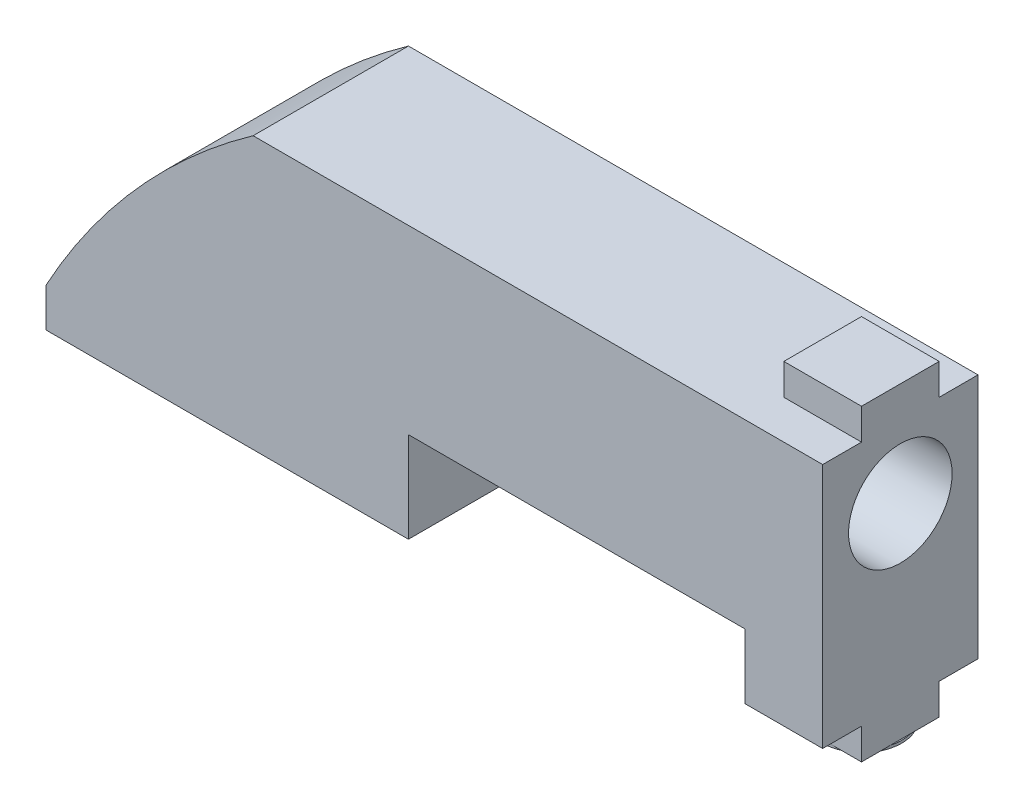
ISO-10303-21;
HEADER;
FILE_DESCRIPTION(('STEP AP214'),'2;1');
FILE_NAME('part.step','',(''),(''),'','','');
FILE_SCHEMA(('AUTOMOTIVE_DESIGN { 1 0 10303 214 1 1 1 1 }'));
ENDSEC;
DATA;
#1=APPLICATION_CONTEXT('core data for automotive mechanical design processes');
#2=APPLICATION_PROTOCOL_DEFINITION('international standard','automotive_design',2000,#1);
#3=PRODUCT_CONTEXT('',#1,'mechanical');
#4=PRODUCT('Part','Part','',(#3));
#5=PRODUCT_RELATED_PRODUCT_CATEGORY('part','',(#4));
#6=PRODUCT_DEFINITION_FORMATION('','',#4);
#7=PRODUCT_DEFINITION_CONTEXT('part definition',#1,'design');
#8=PRODUCT_DEFINITION('design','',#6,#7);
#9=PRODUCT_DEFINITION_SHAPE('','',#8);
#10=(LENGTH_UNIT() NAMED_UNIT(*) SI_UNIT(.MILLI.,.METRE.));
#11=(NAMED_UNIT(*) PLANE_ANGLE_UNIT() SI_UNIT($,.RADIAN.));
#12=(NAMED_UNIT(*) SI_UNIT($,.STERADIAN.) SOLID_ANGLE_UNIT());
#13=UNCERTAINTY_MEASURE_WITH_UNIT(LENGTH_MEASURE(1.E-05),#10,'distance_accuracy_value','');
#14=(GEOMETRIC_REPRESENTATION_CONTEXT(3) GLOBAL_UNCERTAINTY_ASSIGNED_CONTEXT((#13)) GLOBAL_UNIT_ASSIGNED_CONTEXT((#10,
#11,#12)) REPRESENTATION_CONTEXT('',''));
#15=CARTESIAN_POINT('',(0.,0.,0.));
#16=DIRECTION('',(0.,0.,1.));
#17=DIRECTION('',(1.,0.,0.));
#18=AXIS2_PLACEMENT_3D('',#15,#16,#17);
#19=CARTESIAN_POINT('',(30.,-0.199999999999999,-1.5));
#20=DIRECTION('',(0.,-1.,0.));
#21=DIRECTION('',(0.,0.,-1.));
#22=AXIS2_PLACEMENT_3D('',#19,#20,#21);
#23=PLANE('',#22);
#24=CARTESIAN_POINT('',(28.5256154225237,-0.199999999999999,0.));
#25=DIRECTION('',(0.,-1.,0.));
#26=DIRECTION('',(0.,0.,-1.));
#27=AXIS2_PLACEMENT_3D('',#24,#25,#26);
#28=CIRCLE('',#27,1.52561542252374);
#29=CARTESIAN_POINT('',(28.8040079824859,-0.199999999999999,-1.5));
#30=VERTEX_POINT('',#29);
#31=CARTESIAN_POINT('',(30.,-0.199999999999999,-0.392036395175811));
#32=VERTEX_POINT('',#31);
#33=EDGE_CURVE('E57',#30,#32,#28,.T.);
#34=ORIENTED_EDGE('',*,*,#33,.F.);
#35=DIRECTION('',(1.,0.,0.));
#36=VECTOR('',#35,1.);
#37=CARTESIAN_POINT('',(27.,-0.199999999999999,-1.5));
#38=LINE('',#37,#36);
#39=CARTESIAN_POINT('',(30.,-0.199999999999999,-1.5));
#40=VERTEX_POINT('',#39);
#41=EDGE_CURVE('E193',#30,#40,#38,.T.);
#42=ORIENTED_EDGE('',*,*,#41,.T.);
#43=DIRECTION('',(0.,0.,1.));
#44=VECTOR('',#43,1.);
#45=CARTESIAN_POINT('',(30.,-0.199999999999999,1.5));
#46=LINE('',#45,#44);
#47=EDGE_CURVE('E230',#40,#32,#46,.T.);
#48=ORIENTED_EDGE('',*,*,#47,.T.);
#49=EDGE_LOOP('',(#34,#42,#48));
#50=FACE_BOUND('',#49,.T.);
#51=ADVANCED_FACE('F39',(#50),#23,.T.);
#52=CARTESIAN_POINT('',(30.,-0.199999999999999,0.392036395175811));
#53=VERTEX_POINT('',#52);
#54=CARTESIAN_POINT('',(28.8040079824859,-0.199999999999999,1.5));
#55=VERTEX_POINT('',#54);
#56=EDGE_CURVE('E12',#53,#55,#28,.T.);
#57=ORIENTED_EDGE('',*,*,#56,.F.);
#58=CARTESIAN_POINT('',(30.,-0.199999999999999,1.5));
#59=VERTEX_POINT('',#58);
#60=EDGE_CURVE('E242',#53,#59,#46,.T.);
#61=ORIENTED_EDGE('',*,*,#60,.T.);
#62=DIRECTION('',(-1.,0.,0.));
#63=VECTOR('',#62,1.);
#64=CARTESIAN_POINT('',(27.,-0.199999999999999,1.5));
#65=LINE('',#64,#63);
#66=EDGE_CURVE('E227',#59,#55,#65,.T.);
#67=ORIENTED_EDGE('',*,*,#66,.T.);
#68=EDGE_LOOP('',(#57,#61,#67));
#69=FACE_BOUND('',#68,.T.);
#70=ADVANCED_FACE('F419',(#69),#23,.T.);
#71=CARTESIAN_POINT('',(28.2472228625616,-0.199999999999999,1.5));
#72=VERTEX_POINT('',#71);
#73=CARTESIAN_POINT('',(27.,-0.199999999999999,0.));
#74=VERTEX_POINT('',#73);
#75=EDGE_CURVE('E48',#72,#74,#28,.T.);
#76=ORIENTED_EDGE('',*,*,#75,.F.);
#77=CARTESIAN_POINT('',(27.,-0.199999999999999,1.5));
#78=VERTEX_POINT('',#77);
#79=EDGE_CURVE('E228',#72,#78,#65,.T.);
#80=ORIENTED_EDGE('',*,*,#79,.T.);
#81=DIRECTION('',(0.,0.,-1.));
#82=VECTOR('',#81,1.);
#83=CARTESIAN_POINT('',(27.,-0.199999999999999,1.5));
#84=LINE('',#83,#82);
#85=EDGE_CURVE('E234',#78,#74,#84,.T.);
#86=ORIENTED_EDGE('',*,*,#85,.T.);
#87=EDGE_LOOP('',(#76,#80,#86));
#88=FACE_BOUND('',#87,.T.);
#89=ADVANCED_FACE('F424',(#88),#23,.T.);
#90=CARTESIAN_POINT('',(27.,1.,3.));
#91=DIRECTION('',(0.,1.,0.));
#92=DIRECTION('',(0.,0.,1.));
#93=AXIS2_PLACEMENT_3D('',#90,#91,#92);
#94=PLANE('',#93);
#95=DIRECTION('',(-1.,0.,0.));
#96=VECTOR('',#95,1.);
#97=CARTESIAN_POINT('',(27.,1.,1.5));
#98=LINE('',#97,#96);
#99=CARTESIAN_POINT('',(30.,1.,1.5));
#100=VERTEX_POINT('',#99);
#101=CARTESIAN_POINT('',(27.,1.,1.5));
#102=VERTEX_POINT('',#101);
#103=EDGE_CURVE('E237',#100,#102,#98,.T.);
#104=ORIENTED_EDGE('',*,*,#103,.F.);
#105=DIRECTION('',(0.,0.,-1.));
#106=VECTOR('',#105,1.);
#107=CARTESIAN_POINT('',(30.,1.,3.));
#108=LINE('',#107,#106);
#109=CARTESIAN_POINT('',(30.,1.,3.));
#110=VERTEX_POINT('',#109);
#111=EDGE_CURVE('E346',#110,#100,#108,.T.);
#112=ORIENTED_EDGE('',*,*,#111,.F.);
#113=DIRECTION('',(1.,0.,0.));
#114=VECTOR('',#113,1.);
#115=CARTESIAN_POINT('',(27.,1.,3.));
#116=LINE('',#115,#114);
#117=CARTESIAN_POINT('',(27.,1.,3.));
#118=VERTEX_POINT('',#117);
#119=EDGE_CURVE('E304',#118,#110,#116,.T.);
#120=ORIENTED_EDGE('',*,*,#119,.F.);
#121=DIRECTION('',(0.,0.,-1.));
#122=VECTOR('',#121,1.);
#123=CARTESIAN_POINT('',(27.,1.,3.));
#124=LINE('',#123,#122);
#125=EDGE_CURVE('E359',#118,#102,#124,.T.);
#126=ORIENTED_EDGE('',*,*,#125,.T.);
#127=EDGE_LOOP('',(#104,#112,#120,#126));
#128=FACE_BOUND('',#127,.T.);
#129=ADVANCED_FACE('F438',(#128),#94,.F.);
#130=DIRECTION('',(1.,0.,0.));
#131=VECTOR('',#130,1.);
#132=CARTESIAN_POINT('',(27.,1.,-1.5));
#133=LINE('',#132,#131);
#134=CARTESIAN_POINT('',(27.,1.,-1.5));
#135=VERTEX_POINT('',#134);
#136=CARTESIAN_POINT('',(30.,1.,-1.5));
#137=VERTEX_POINT('',#136);
#138=EDGE_CURVE('E239',#135,#137,#133,.T.);
#139=ORIENTED_EDGE('',*,*,#138,.F.);
#140=CARTESIAN_POINT('',(27.,1.,-3.));
#141=VERTEX_POINT('',#140);
#142=EDGE_CURVE('E361',#135,#141,#124,.T.);
#143=ORIENTED_EDGE('',*,*,#142,.T.);
#144=DIRECTION('',(1.,0.,0.));
#145=VECTOR('',#144,1.);
#146=CARTESIAN_POINT('',(27.,1.,-3.));
#147=LINE('',#146,#145);
#148=CARTESIAN_POINT('',(30.,1.,-3.));
#149=VERTEX_POINT('',#148);
#150=EDGE_CURVE('E324',#141,#149,#147,.T.);
#151=ORIENTED_EDGE('',*,*,#150,.T.);
#152=EDGE_CURVE('E353',#137,#149,#108,.T.);
#153=ORIENTED_EDGE('',*,*,#152,.F.);
#154=EDGE_LOOP('',(#139,#143,#151,#153));
#155=FACE_BOUND('',#154,.T.);
#156=ADVANCED_FACE('F380',(#155),#94,.F.);
#157=CARTESIAN_POINT('',(8.,10.5,3.));
#158=DIRECTION('',(0.,-1.,0.));
#159=DIRECTION('',(0.,0.,-1.));
#160=AXIS2_PLACEMENT_3D('',#157,#158,#159);
#161=PLANE('',#160);
#162=DIRECTION('',(1.,0.,0.));
#163=VECTOR('',#162,1.);
#164=CARTESIAN_POINT('',(30.,10.5,1.5));
#165=LINE('',#164,#163);
#166=CARTESIAN_POINT('',(27.,10.5,1.5));
#167=VERTEX_POINT('',#166);
#168=CARTESIAN_POINT('',(30.,10.5,1.5));
#169=VERTEX_POINT('',#168);
#170=EDGE_CURVE('E256',#167,#169,#165,.T.);
#171=ORIENTED_EDGE('',*,*,#170,.F.);
#172=DIRECTION('',(0.,0.,1.));
#173=VECTOR('',#172,1.);
#174=CARTESIAN_POINT('',(27.,10.5,-1.5));
#175=LINE('',#174,#173);
#176=CARTESIAN_POINT('',(27.,10.5,-1.5));
#177=VERTEX_POINT('',#176);
#178=EDGE_CURVE('E263',#177,#167,#175,.T.);
#179=ORIENTED_EDGE('',*,*,#178,.F.);
#180=DIRECTION('',(-1.,0.,0.));
#181=VECTOR('',#180,1.);
#182=CARTESIAN_POINT('',(30.,10.5,-1.5));
#183=LINE('',#182,#181);
#184=CARTESIAN_POINT('',(30.,10.5,-1.5));
#185=VERTEX_POINT('',#184);
#186=EDGE_CURVE('E251',#185,#177,#183,.T.);
#187=ORIENTED_EDGE('',*,*,#186,.F.);
#188=DIRECTION('',(0.,0.,-1.));
#189=VECTOR('',#188,1.);
#190=CARTESIAN_POINT('',(30.,10.5,3.));
#191=LINE('',#190,#189);
#192=CARTESIAN_POINT('',(30.,10.5,-3.));
#193=VERTEX_POINT('',#192);
#194=EDGE_CURVE('E343',#185,#193,#191,.T.);
#195=ORIENTED_EDGE('',*,*,#194,.T.);
#196=DIRECTION('',(-1.,0.,0.));
#197=VECTOR('',#196,1.);
#198=CARTESIAN_POINT('',(8.,10.5,-3.));
#199=LINE('',#198,#197);
#200=CARTESIAN_POINT('',(8.,10.5,-3.));
#201=VERTEX_POINT('',#200);
#202=EDGE_CURVE('E330',#193,#201,#199,.T.);
#203=ORIENTED_EDGE('',*,*,#202,.T.);
#204=DIRECTION('',(0.,0.,-1.));
#205=VECTOR('',#204,1.);
#206=CARTESIAN_POINT('',(8.,10.5,3.));
#207=LINE('',#206,#205);
#208=CARTESIAN_POINT('',(8.,10.5,3.));
#209=VERTEX_POINT('',#208);
#210=EDGE_CURVE('E340',#209,#201,#207,.T.);
#211=ORIENTED_EDGE('',*,*,#210,.F.);
#212=DIRECTION('',(-1.,0.,0.));
#213=VECTOR('',#212,1.);
#214=CARTESIAN_POINT('',(8.,10.5,3.));
#215=LINE('',#214,#213);
#216=CARTESIAN_POINT('',(30.,10.5,3.));
#217=VERTEX_POINT('',#216);
#218=EDGE_CURVE('E308',#217,#209,#215,.T.);
#219=ORIENTED_EDGE('',*,*,#218,.F.);
#220=EDGE_CURVE('E352',#217,#169,#191,.T.);
#221=ORIENTED_EDGE('',*,*,#220,.T.);
#222=EDGE_LOOP('',(#171,#179,#187,#195,#203,#211,#219,#221));
#223=FACE_BOUND('',#222,.T.);
#224=ADVANCED_FACE('F389',(#223),#161,.F.);
#225=CARTESIAN_POINT('',(14.,0.,3.));
#226=DIRECTION('',(0.,1.,0.));
#227=DIRECTION('',(-1.,0.,0.));
#228=AXIS2_PLACEMENT_3D('',#225,#226,#227);
#229=PLANE('',#228);
#230=DIRECTION('',(1.,0.,0.));
#231=VECTOR('',#230,1.);
#232=CARTESIAN_POINT('',(14.,0.,-3.));
#233=LINE('',#232,#231);
#234=CARTESIAN_POINT('',(0.,0.,-3.));
#235=VERTEX_POINT('',#234);
#236=CARTESIAN_POINT('',(14.,0.,-3.));
#237=VERTEX_POINT('',#236);
#238=EDGE_CURVE('E291',#235,#237,#233,.T.);
#239=ORIENTED_EDGE('',*,*,#238,.T.);
#240=DIRECTION('',(0.,0.,-1.));
#241=VECTOR('',#240,1.);
#242=CARTESIAN_POINT('',(14.,0.,3.));
#243=LINE('',#242,#241);
#244=CARTESIAN_POINT('',(14.,0.,3.));
#245=VERTEX_POINT('',#244);
#246=EDGE_CURVE('E208',#245,#237,#243,.T.);
#247=ORIENTED_EDGE('',*,*,#246,.F.);
#248=DIRECTION('',(1.,0.,0.));
#249=VECTOR('',#248,1.);
#250=CARTESIAN_POINT('',(14.,0.,3.));
#251=LINE('',#250,#249);
#252=CARTESIAN_POINT('',(0.,0.,3.));
#253=VERTEX_POINT('',#252);
#254=EDGE_CURVE('E293',#253,#245,#251,.T.);
#255=ORIENTED_EDGE('',*,*,#254,.F.);
#256=DIRECTION('',(0.,0.,-1.));
#257=VECTOR('',#256,1.);
#258=CARTESIAN_POINT('',(0.,0.,3.));
#259=LINE('',#258,#257);
#260=EDGE_CURVE('E314',#253,#235,#259,.T.);
#261=ORIENTED_EDGE('',*,*,#260,.T.);
#262=EDGE_LOOP('',(#239,#247,#255,#261));
#263=FACE_BOUND('',#262,.T.);
#264=ADVANCED_FACE('F41',(#263),#229,.F.);
#265=CARTESIAN_POINT('',(14.,3.5,3.));
#266=DIRECTION('',(-1.,0.,0.));
#267=DIRECTION('',(0.,-1.,0.));
#268=AXIS2_PLACEMENT_3D('',#265,#266,#267);
#269=PLANE('',#268);
#270=DIRECTION('',(0.,1.,0.));
#271=VECTOR('',#270,1.);
#272=CARTESIAN_POINT('',(14.,3.5,-3.));
#273=LINE('',#272,#271);
#274=CARTESIAN_POINT('',(14.,3.5,-3.));
#275=VERTEX_POINT('',#274);
#276=EDGE_CURVE('E317',#237,#275,#273,.T.);
#277=ORIENTED_EDGE('',*,*,#276,.T.);
#278=DIRECTION('',(0.,0.,-1.));
#279=VECTOR('',#278,1.);
#280=CARTESIAN_POINT('',(14.,3.5,3.));
#281=LINE('',#280,#279);
#282=CARTESIAN_POINT('',(14.,3.5,3.));
#283=VERTEX_POINT('',#282);
#284=EDGE_CURVE('E210',#283,#275,#281,.T.);
#285=ORIENTED_EDGE('',*,*,#284,.F.);
#286=DIRECTION('',(0.,1.,0.));
#287=VECTOR('',#286,1.);
#288=CARTESIAN_POINT('',(14.,3.5,3.));
#289=LINE('',#288,#287);
#290=EDGE_CURVE('E297',#245,#283,#289,.T.);
#291=ORIENTED_EDGE('',*,*,#290,.F.);
#292=ORIENTED_EDGE('',*,*,#246,.T.);
#293=EDGE_LOOP('',(#277,#285,#291,#292));
#294=FACE_BOUND('',#293,.T.);
#295=ADVANCED_FACE('F459',(#294),#269,.F.);
#296=CARTESIAN_POINT('',(27.,3.5,3.));
#297=DIRECTION('',(0.,1.,0.));
#298=DIRECTION('',(-1.,0.,0.));
#299=AXIS2_PLACEMENT_3D('',#296,#297,#298);
#300=PLANE('',#299);
#301=DIRECTION('',(1.,0.,0.));
#302=VECTOR('',#301,1.);
#303=CARTESIAN_POINT('',(27.,3.5,-3.));
#304=LINE('',#303,#302);
#305=CARTESIAN_POINT('',(27.,3.5,-3.));
#306=VERTEX_POINT('',#305);
#307=EDGE_CURVE('E319',#275,#306,#304,.T.);
#308=ORIENTED_EDGE('',*,*,#307,.T.);
#309=DIRECTION('',(0.,0.,-1.));
#310=VECTOR('',#309,1.);
#311=CARTESIAN_POINT('',(27.,3.5,3.));
#312=LINE('',#311,#310);
#313=CARTESIAN_POINT('',(27.,3.5,3.));
#314=VERTEX_POINT('',#313);
#315=EDGE_CURVE('E357',#314,#306,#312,.T.);
#316=ORIENTED_EDGE('',*,*,#315,.F.);
#317=DIRECTION('',(1.,0.,0.));
#318=VECTOR('',#317,1.);
#319=CARTESIAN_POINT('',(27.,3.5,3.));
#320=LINE('',#319,#318);
#321=EDGE_CURVE('E300',#283,#314,#320,.T.);
#322=ORIENTED_EDGE('',*,*,#321,.F.);
#323=ORIENTED_EDGE('',*,*,#284,.T.);
#324=EDGE_LOOP('',(#308,#316,#322,#323));
#325=FACE_BOUND('',#324,.T.);
#326=ADVANCED_FACE('F456',(#325),#300,.F.);
#327=CARTESIAN_POINT('',(27.,1.,3.));
#328=DIRECTION('',(1.,0.,0.));
#329=DIRECTION('',(0.,1.,0.));
#330=AXIS2_PLACEMENT_3D('',#327,#328,#329);
#331=PLANE('',#330);
#332=DIRECTION('',(0.,-1.,0.));
#333=VECTOR('',#332,1.);
#334=CARTESIAN_POINT('',(27.,1.,-3.));
#335=LINE('',#334,#333);
#336=EDGE_CURVE('E321',#306,#141,#335,.T.);
#337=ORIENTED_EDGE('',*,*,#336,.T.);
#338=ORIENTED_EDGE('',*,*,#142,.F.);
#339=DIRECTION('',(0.,1.,0.));
#340=VECTOR('',#339,1.);
#341=CARTESIAN_POINT('',(27.,-0.199999999999999,-1.5));
#342=LINE('',#341,#340);
#343=CARTESIAN_POINT('',(27.,-0.199999999999999,-1.5));
#344=VERTEX_POINT('',#343);
#345=EDGE_CURVE('E244',#344,#135,#342,.T.);
#346=ORIENTED_EDGE('',*,*,#345,.F.);
#347=EDGE_CURVE('E187',#74,#344,#84,.T.);
#348=ORIENTED_EDGE('',*,*,#347,.F.);
#349=ORIENTED_EDGE('',*,*,#85,.F.);
#350=DIRECTION('',(0.,1.,0.));
#351=VECTOR('',#350,1.);
#352=CARTESIAN_POINT('',(27.,-0.199999999999999,1.5));
#353=LINE('',#352,#351);
#354=EDGE_CURVE('E246',#78,#102,#353,.T.);
#355=ORIENTED_EDGE('',*,*,#354,.T.);
#356=ORIENTED_EDGE('',*,*,#125,.F.);
#357=DIRECTION('',(0.,-1.,0.));
#358=VECTOR('',#357,1.);
#359=CARTESIAN_POINT('',(27.,1.,3.));
#360=LINE('',#359,#358);
#361=EDGE_CURVE('E302',#314,#118,#360,.T.);
#362=ORIENTED_EDGE('',*,*,#361,.F.);
#363=ORIENTED_EDGE('',*,*,#315,.T.);
#364=EDGE_LOOP('',(#337,#338,#346,#348,#349,#355,#356,#362,#363));
#365=FACE_BOUND('',#364,.T.);
#366=ADVANCED_FACE('F447',(#365),#331,.F.);
#367=CARTESIAN_POINT('',(30.,10.5,3.));
#368=DIRECTION('',(-1.,0.,0.));
#369=DIRECTION('',(0.,-1.,0.));
#370=AXIS2_PLACEMENT_3D('',#367,#368,#369);
#371=PLANE('',#370);
#372=CARTESIAN_POINT('',(30.,7.7,0.));
#373=DIRECTION('',(1.,0.,0.));
#374=DIRECTION('',(0.,0.,-1.));
#375=AXIS2_PLACEMENT_3D('',#372,#373,#374);
#376=CIRCLE('',#375,2.);
#377=CARTESIAN_POINT('',(30.,7.7,-2.));
#378=VERTEX_POINT('',#377);
#379=EDGE_CURVE('E240',#378,#378,#376,.T.);
#380=ORIENTED_EDGE('',*,*,#379,.F.);
#381=EDGE_LOOP('',(#380));
#382=FACE_BOUND('',#381,.T.);
#383=DIRECTION('',(0.,1.,0.));
#384=VECTOR('',#383,1.);
#385=CARTESIAN_POINT('',(30.,10.5,-3.));
#386=LINE('',#385,#384);
#387=EDGE_CURVE('E327',#149,#193,#386,.T.);
#388=ORIENTED_EDGE('',*,*,#387,.T.);
#389=ORIENTED_EDGE('',*,*,#194,.F.);
#390=DIRECTION('',(0.,-1.,0.));
#391=VECTOR('',#390,1.);
#392=CARTESIAN_POINT('',(30.,11.7,-1.5));
#393=LINE('',#392,#391);
#394=CARTESIAN_POINT('',(30.,11.7,-1.5));
#395=VERTEX_POINT('',#394);
#396=EDGE_CURVE('E286',#395,#185,#393,.T.);
#397=ORIENTED_EDGE('',*,*,#396,.F.);
#398=DIRECTION('',(0.,0.,-1.));
#399=VECTOR('',#398,1.);
#400=CARTESIAN_POINT('',(30.,11.7,-1.5));
#401=LINE('',#400,#399);
#402=CARTESIAN_POINT('',(30.,11.7,1.5));
#403=VERTEX_POINT('',#402);
#404=EDGE_CURVE('E252',#403,#395,#401,.T.);
#405=ORIENTED_EDGE('',*,*,#404,.F.);
#406=DIRECTION('',(0.,-1.,0.));
#407=VECTOR('',#406,1.);
#408=CARTESIAN_POINT('',(30.,11.7,1.5));
#409=LINE('',#408,#407);
#410=EDGE_CURVE('E262',#403,#169,#409,.T.);
#411=ORIENTED_EDGE('',*,*,#410,.T.);
#412=ORIENTED_EDGE('',*,*,#220,.F.);
#413=DIRECTION('',(0.,1.,0.));
#414=VECTOR('',#413,1.);
#415=CARTESIAN_POINT('',(30.,10.5,3.));
#416=LINE('',#415,#414);
#417=EDGE_CURVE('E306',#110,#217,#416,.T.);
#418=ORIENTED_EDGE('',*,*,#417,.F.);
#419=ORIENTED_EDGE('',*,*,#111,.T.);
#420=DIRECTION('',(0.,1.,0.));
#421=VECTOR('',#420,1.);
#422=CARTESIAN_POINT('',(30.,-0.199999999999999,1.5));
#423=LINE('',#422,#421);
#424=EDGE_CURVE('E249',#59,#100,#423,.T.);
#425=ORIENTED_EDGE('',*,*,#424,.F.);
#426=ORIENTED_EDGE('',*,*,#60,.F.);
#427=EDGE_CURVE('E450',#32,#53,#46,.T.);
#428=ORIENTED_EDGE('',*,*,#427,.F.);
#429=ORIENTED_EDGE('',*,*,#47,.F.);
#430=DIRECTION('',(0.,1.,0.));
#431=VECTOR('',#430,1.);
#432=CARTESIAN_POINT('',(30.,-0.199999999999999,-1.5));
#433=LINE('',#432,#431);
#434=EDGE_CURVE('E190',#40,#137,#433,.T.);
#435=ORIENTED_EDGE('',*,*,#434,.T.);
#436=ORIENTED_EDGE('',*,*,#152,.T.);
#437=EDGE_LOOP('',(#388,#389,#397,#405,#411,#412,#418,#419,#425,#426,#428,#429,#435,#436));
#438=FACE_BOUND('',#437,.T.);
#439=ADVANCED_FACE('F374',(#382,#438),#371,.F.);
#440=CARTESIAN_POINT('',(23.3665507302786,-11.2147117602476,3.));
#441=DIRECTION('',(0.,0.,-1.));
#442=DIRECTION('',(-1.,0.,0.));
#443=AXIS2_PLACEMENT_3D('',#440,#441,#442);
#444=CYLINDRICAL_SURFACE('',#443,26.6018718923474);
#445=CARTESIAN_POINT('',(23.3665507302786,-11.2147117602476,-3.));
#446=DIRECTION('',(0.,0.,1.));
#447=DIRECTION('',(1.,0.,0.));
#448=AXIS2_PLACEMENT_3D('',#445,#446,#447);
#449=CIRCLE('',#448,26.6018718923474);
#450=CARTESIAN_POINT('',(0.,1.5,-3.));
#451=VERTEX_POINT('',#450);
#452=EDGE_CURVE('E332',#201,#451,#449,.T.);
#453=ORIENTED_EDGE('',*,*,#452,.T.);
#454=DIRECTION('',(0.,0.,-1.));
#455=VECTOR('',#454,1.);
#456=CARTESIAN_POINT('',(0.,1.5,3.));
#457=LINE('',#456,#455);
#458=CARTESIAN_POINT('',(0.,1.5,3.));
#459=VERTEX_POINT('',#458);
#460=EDGE_CURVE('E337',#459,#451,#457,.T.);
#461=ORIENTED_EDGE('',*,*,#460,.F.);
#462=CARTESIAN_POINT('',(23.3665507302786,-11.2147117602476,3.));
#463=DIRECTION('',(0.,0.,1.));
#464=DIRECTION('',(1.,0.,0.));
#465=AXIS2_PLACEMENT_3D('',#462,#463,#464);
#466=CIRCLE('',#465,26.6018718923474);
#467=EDGE_CURVE('E310',#209,#459,#466,.T.);
#468=ORIENTED_EDGE('',*,*,#467,.F.);
#469=ORIENTED_EDGE('',*,*,#210,.T.);
#470=EDGE_LOOP('',(#453,#461,#468,#469));
#471=FACE_BOUND('',#470,.T.);
#472=ADVANCED_FACE('F393',(#471),#444,.T.);
#473=CARTESIAN_POINT('',(0.,0.,3.));
#474=DIRECTION('',(1.,0.,0.));
#475=DIRECTION('',(0.,0.,-1.));
#476=AXIS2_PLACEMENT_3D('',#473,#474,#475);
#477=PLANE('',#476);
#478=DIRECTION('',(0.,-1.,0.));
#479=VECTOR('',#478,1.);
#480=CARTESIAN_POINT('',(0.,0.,-3.));
#481=LINE('',#480,#479);
#482=EDGE_CURVE('E298',#451,#235,#481,.T.);
#483=ORIENTED_EDGE('',*,*,#482,.T.);
#484=ORIENTED_EDGE('',*,*,#260,.F.);
#485=DIRECTION('',(0.,-1.,0.));
#486=VECTOR('',#485,1.);
#487=CARTESIAN_POINT('',(0.,0.,3.));
#488=LINE('',#487,#486);
#489=EDGE_CURVE('E312',#459,#253,#488,.T.);
#490=ORIENTED_EDGE('',*,*,#489,.F.);
#491=ORIENTED_EDGE('',*,*,#460,.T.);
#492=EDGE_LOOP('',(#483,#484,#490,#491));
#493=FACE_BOUND('',#492,.T.);
#494=ADVANCED_FACE('F464',(#493),#477,.F.);
#495=CARTESIAN_POINT('',(23.3665507302786,-11.2147117602476,3.));
#496=DIRECTION('',(0.,0.,1.));
#497=DIRECTION('',(1.,0.,0.));
#498=AXIS2_PLACEMENT_3D('',#495,#496,#497);
#499=PLANE('',#498);
#500=ORIENTED_EDGE('',*,*,#254,.T.);
#501=ORIENTED_EDGE('',*,*,#290,.T.);
#502=ORIENTED_EDGE('',*,*,#321,.T.);
#503=ORIENTED_EDGE('',*,*,#361,.T.);
#504=ORIENTED_EDGE('',*,*,#119,.T.);
#505=ORIENTED_EDGE('',*,*,#417,.T.);
#506=ORIENTED_EDGE('',*,*,#218,.T.);
#507=ORIENTED_EDGE('',*,*,#467,.T.);
#508=ORIENTED_EDGE('',*,*,#489,.T.);
#509=EDGE_LOOP('',(#500,#501,#502,#503,#504,#505,#506,#507,#508));
#510=FACE_BOUND('',#509,.T.);
#511=ADVANCED_FACE('F397',(#510),#499,.T.);
#512=CARTESIAN_POINT('',(23.3665507302786,-11.2147117602476,-3.));
#513=DIRECTION('',(0.,0.,1.));
#514=DIRECTION('',(1.,0.,0.));
#515=AXIS2_PLACEMENT_3D('',#512,#513,#514);
#516=PLANE('',#515);
#517=ORIENTED_EDGE('',*,*,#238,.F.);
#518=ORIENTED_EDGE('',*,*,#482,.F.);
#519=ORIENTED_EDGE('',*,*,#452,.F.);
#520=ORIENTED_EDGE('',*,*,#202,.F.);
#521=ORIENTED_EDGE('',*,*,#387,.F.);
#522=ORIENTED_EDGE('',*,*,#150,.F.);
#523=ORIENTED_EDGE('',*,*,#336,.F.);
#524=ORIENTED_EDGE('',*,*,#307,.F.);
#525=ORIENTED_EDGE('',*,*,#276,.F.);
#526=EDGE_LOOP('',(#517,#518,#519,#520,#521,#522,#523,#524,#525));
#527=FACE_BOUND('',#526,.T.);
#528=ADVANCED_FACE('F384',(#527),#516,.F.);
#529=CARTESIAN_POINT('',(30.,11.7,-1.5));
#530=DIRECTION('',(0.,0.,1.));
#531=DIRECTION('',(1.,0.,0.));
#532=AXIS2_PLACEMENT_3D('',#529,#530,#531);
#533=PLANE('',#532);
#534=ORIENTED_EDGE('',*,*,#186,.T.);
#535=DIRECTION('',(0.,-1.,0.));
#536=VECTOR('',#535,1.);
#537=CARTESIAN_POINT('',(27.,11.7,-1.5));
#538=LINE('',#537,#536);
#539=CARTESIAN_POINT('',(27.,11.7,-1.5));
#540=VERTEX_POINT('',#539);
#541=EDGE_CURVE('E281',#540,#177,#538,.T.);
#542=ORIENTED_EDGE('',*,*,#541,.F.);
#543=DIRECTION('',(-1.,0.,0.));
#544=VECTOR('',#543,1.);
#545=CARTESIAN_POINT('',(30.,11.7,-1.5));
#546=LINE('',#545,#544);
#547=EDGE_CURVE('E255',#395,#540,#546,.T.);
#548=ORIENTED_EDGE('',*,*,#547,.F.);
#549=ORIENTED_EDGE('',*,*,#396,.T.);
#550=EDGE_LOOP('',(#534,#542,#548,#549));
#551=FACE_BOUND('',#550,.T.);
#552=ADVANCED_FACE('F406',(#551),#533,.F.);
#553=CARTESIAN_POINT('',(27.,11.7,-1.5));
#554=DIRECTION('',(1.,0.,0.));
#555=DIRECTION('',(0.,0.,-1.));
#556=AXIS2_PLACEMENT_3D('',#553,#554,#555);
#557=PLANE('',#556);
#558=ORIENTED_EDGE('',*,*,#178,.T.);
#559=DIRECTION('',(0.,-1.,0.));
#560=VECTOR('',#559,1.);
#561=CARTESIAN_POINT('',(27.,11.7,1.5));
#562=LINE('',#561,#560);
#563=CARTESIAN_POINT('',(27.,11.7,1.5));
#564=VERTEX_POINT('',#563);
#565=EDGE_CURVE('E268',#564,#167,#562,.T.);
#566=ORIENTED_EDGE('',*,*,#565,.F.);
#567=DIRECTION('',(0.,0.,1.));
#568=VECTOR('',#567,1.);
#569=CARTESIAN_POINT('',(27.,11.7,-1.5));
#570=LINE('',#569,#568);
#571=EDGE_CURVE('E258',#540,#564,#570,.T.);
#572=ORIENTED_EDGE('',*,*,#571,.F.);
#573=ORIENTED_EDGE('',*,*,#541,.T.);
#574=EDGE_LOOP('',(#558,#566,#572,#573));
#575=FACE_BOUND('',#574,.T.);
#576=ADVANCED_FACE('F403',(#575),#557,.F.);
#577=CARTESIAN_POINT('',(30.,11.7,1.5));
#578=DIRECTION('',(0.,0.,-1.));
#579=DIRECTION('',(-1.,0.,0.));
#580=AXIS2_PLACEMENT_3D('',#577,#578,#579);
#581=PLANE('',#580);
#582=ORIENTED_EDGE('',*,*,#170,.T.);
#583=ORIENTED_EDGE('',*,*,#410,.F.);
#584=DIRECTION('',(1.,0.,0.));
#585=VECTOR('',#584,1.);
#586=CARTESIAN_POINT('',(30.,11.7,1.5));
#587=LINE('',#586,#585);
#588=EDGE_CURVE('E260',#564,#403,#587,.T.);
#589=ORIENTED_EDGE('',*,*,#588,.F.);
#590=ORIENTED_EDGE('',*,*,#565,.T.);
#591=EDGE_LOOP('',(#582,#583,#589,#590));
#592=FACE_BOUND('',#591,.T.);
#593=ADVANCED_FACE('F399',(#592),#581,.F.);
#594=CARTESIAN_POINT('',(30.,11.7,1.5));
#595=DIRECTION('',(0.,-1.,0.));
#596=DIRECTION('',(0.,0.,-1.));
#597=AXIS2_PLACEMENT_3D('',#594,#595,#596);
#598=PLANE('',#597);
#599=ORIENTED_EDGE('',*,*,#404,.T.);
#600=ORIENTED_EDGE('',*,*,#547,.T.);
#601=ORIENTED_EDGE('',*,*,#571,.T.);
#602=ORIENTED_EDGE('',*,*,#588,.T.);
#603=EDGE_LOOP('',(#599,#600,#601,#602));
#604=FACE_BOUND('',#603,.T.);
#605=ADVANCED_FACE('F402',(#604),#598,.F.);
#606=CARTESIAN_POINT('',(27.,-0.199999999999999,1.5));
#607=DIRECTION('',(0.,0.,-1.));
#608=DIRECTION('',(-1.,0.,0.));
#609=AXIS2_PLACEMENT_3D('',#606,#607,#608);
#610=PLANE('',#609);
#611=ORIENTED_EDGE('',*,*,#103,.T.);
#612=ORIENTED_EDGE('',*,*,#354,.F.);
#613=ORIENTED_EDGE('',*,*,#79,.F.);
#614=EDGE_CURVE('E222',#55,#72,#65,.T.);
#615=ORIENTED_EDGE('',*,*,#614,.F.);
#616=ORIENTED_EDGE('',*,*,#66,.F.);
#617=ORIENTED_EDGE('',*,*,#424,.T.);
#618=EDGE_LOOP('',(#611,#612,#613,#615,#616,#617));
#619=FACE_BOUND('',#618,.T.);
#620=ADVANCED_FACE('F436',(#619),#610,.F.);
#621=CARTESIAN_POINT('',(27.,-0.199999999999999,-1.5));
#622=DIRECTION('',(0.,0.,1.));
#623=DIRECTION('',(1.,0.,0.));
#624=AXIS2_PLACEMENT_3D('',#621,#622,#623);
#625=PLANE('',#624);
#626=ORIENTED_EDGE('',*,*,#138,.T.);
#627=ORIENTED_EDGE('',*,*,#434,.F.);
#628=ORIENTED_EDGE('',*,*,#41,.F.);
#629=CARTESIAN_POINT('',(28.2472228625616,-0.199999999999999,-1.5));
#630=VERTEX_POINT('',#629);
#631=EDGE_CURVE('E191',#630,#30,#38,.T.);
#632=ORIENTED_EDGE('',*,*,#631,.F.);
#633=EDGE_CURVE('E184',#344,#630,#38,.T.);
#634=ORIENTED_EDGE('',*,*,#633,.F.);
#635=ORIENTED_EDGE('',*,*,#345,.T.);
#636=EDGE_LOOP('',(#626,#627,#628,#632,#634,#635));
#637=FACE_BOUND('',#636,.T.);
#638=ADVANCED_FACE('F197',(#637),#625,.F.);
#639=EDGE_CURVE('E65',#74,#630,#28,.T.);
#640=ORIENTED_EDGE('',*,*,#639,.F.);
#641=ORIENTED_EDGE('',*,*,#347,.T.);
#642=ORIENTED_EDGE('',*,*,#633,.T.);
#643=EDGE_LOOP('',(#640,#641,#642));
#644=FACE_BOUND('',#643,.T.);
#645=ADVANCED_FACE('F186',(#644),#23,.T.);
#646=CARTESIAN_POINT('',(30.,7.7,0.));
#647=DIRECTION('',(1.,0.,0.));
#648=DIRECTION('',(0.,0.,-1.));
#649=AXIS2_PLACEMENT_3D('',#646,#647,#648);
#650=CYLINDRICAL_SURFACE('',#649,2.);
#651=CARTESIAN_POINT('',(27.,7.7,0.));
#652=DIRECTION('',(1.,0.,0.));
#653=DIRECTION('',(0.,0.,-1.));
#654=AXIS2_PLACEMENT_3D('',#651,#652,#653);
#655=CIRCLE('',#654,2.);
#656=CARTESIAN_POINT('',(27.,7.7,-2.));
#657=VERTEX_POINT('',#656);
#658=EDGE_CURVE('E216',#657,#657,#655,.T.);
#659=ORIENTED_EDGE('',*,*,#658,.F.);
#660=EDGE_LOOP('',(#659));
#661=FACE_BOUND('',#660,.T.);
#662=ORIENTED_EDGE('',*,*,#379,.T.);
#663=EDGE_LOOP('',(#662));
#664=FACE_BOUND('',#663,.T.);
#665=ADVANCED_FACE('F429',(#661,#664),#650,.F.);
#666=CARTESIAN_POINT('',(27.,7.7,0.));
#667=DIRECTION('',(1.,0.,0.));
#668=DIRECTION('',(0.,0.,-1.));
#669=AXIS2_PLACEMENT_3D('',#666,#667,#668);
#670=CONICAL_SURFACE('',#669,2.,1.02974425867665);
#671=CARTESIAN_POINT('',(25.7982787619449,7.7,0.));
#672=VERTEX_POINT('',#671);
#673=VERTEX_LOOP('',#672);
#674=FACE_BOUND('',#673,.T.);
#675=ORIENTED_EDGE('',*,*,#658,.T.);
#676=EDGE_LOOP('',(#675));
#677=FACE_BOUND('',#676,.T.);
#678=ADVANCED_FACE('F434',(#674,#677),#670,.F.);
#679=CARTESIAN_POINT('',(28.5256154225237,-0.199999999999999,0.));
#680=DIRECTION('',(0.,-1.,0.));
#681=DIRECTION('',(0.,0.,-1.));
#682=AXIS2_PLACEMENT_3D('',#679,#680,#681);
#683=PLANE('',#682);
#684=EDGE_CURVE('E50',#32,#53,#28,.T.);
#685=ORIENTED_EDGE('',*,*,#684,.F.);
#686=ORIENTED_EDGE('',*,*,#427,.T.);
#687=EDGE_LOOP('',(#685,#686));
#688=FACE_BOUND('',#687,.T.);
#689=ADVANCED_FACE('F602',(#688),#683,.F.);
#690=EDGE_CURVE('E204',#55,#72,#28,.T.);
#691=ORIENTED_EDGE('',*,*,#690,.F.);
#692=ORIENTED_EDGE('',*,*,#614,.T.);
#693=EDGE_LOOP('',(#691,#692));
#694=FACE_BOUND('',#693,.T.);
#695=ADVANCED_FACE('F221',(#694),#683,.F.);
#696=EDGE_CURVE('E201',#630,#30,#28,.T.);
#697=ORIENTED_EDGE('',*,*,#696,.F.);
#698=ORIENTED_EDGE('',*,*,#631,.T.);
#699=EDGE_LOOP('',(#697,#698));
#700=FACE_BOUND('',#699,.T.);
#701=ADVANCED_FACE('F202',(#700),#683,.F.);
#702=CARTESIAN_POINT('',(28.5256154225237,-0.299999999999999,0.));
#703=DIRECTION('',(0.,1.,0.));
#704=DIRECTION('',(0.,0.,1.));
#705=AXIS2_PLACEMENT_3D('',#702,#703,#704);
#706=CYLINDRICAL_SURFACE('',#705,1.52561542252374);
#707=CARTESIAN_POINT('',(28.5256154225237,-0.299999999999999,0.));
#708=DIRECTION('',(0.,-1.,0.));
#709=DIRECTION('',(0.,0.,-1.));
#710=AXIS2_PLACEMENT_3D('',#707,#708,#709);
#711=CIRCLE('',#710,1.52561542252374);
#712=CARTESIAN_POINT('',(28.5256154225237,-0.299999999999999,-1.52561542252374));
#713=VERTEX_POINT('',#712);
#714=EDGE_CURVE('E213',#713,#713,#711,.T.);
#715=ORIENTED_EDGE('',*,*,#714,.F.);
#716=EDGE_LOOP('',(#715));
#717=FACE_BOUND('',#716,.T.);
#718=ORIENTED_EDGE('',*,*,#33,.T.);
#719=ORIENTED_EDGE('',*,*,#684,.T.);
#720=ORIENTED_EDGE('',*,*,#56,.T.);
#721=ORIENTED_EDGE('',*,*,#690,.T.);
#722=ORIENTED_EDGE('',*,*,#75,.T.);
#723=ORIENTED_EDGE('',*,*,#639,.T.);
#724=ORIENTED_EDGE('',*,*,#696,.T.);
#725=EDGE_LOOP('',(#718,#719,#720,#721,#722,#723,#724));
#726=FACE_BOUND('',#725,.T.);
#727=ADVANCED_FACE('F206',(#717,#726),#706,.T.);
#728=CARTESIAN_POINT('',(28.5256154225237,-0.299999999999999,0.));
#729=DIRECTION('',(0.,-1.,0.));
#730=DIRECTION('',(0.,0.,-1.));
#731=AXIS2_PLACEMENT_3D('',#728,#729,#730);
#732=PLANE('',#731);
#733=ORIENTED_EDGE('',*,*,#714,.T.);
#734=EDGE_LOOP('',(#733));
#735=FACE_BOUND('',#734,.T.);
#736=ADVANCED_FACE('F632',(#735),#732,.T.);
#737=CLOSED_SHELL('',(#51,#70,#89,#129,#156,#224,#264,#295,#326,#366,#439,#472,#494,#511,#528,
#552,#576,#593,#605,#620,#638,#645,#665,#678,#689,#695,#701,#727,#736));
#738=MANIFOLD_SOLID_BREP('B2',#737);
#739=ADVANCED_BREP_SHAPE_REPRESENTATION('',(#18,#738),#14);
#740=SHAPE_DEFINITION_REPRESENTATION(#9,#739);
ENDSEC;
END-ISO-10303-21;
